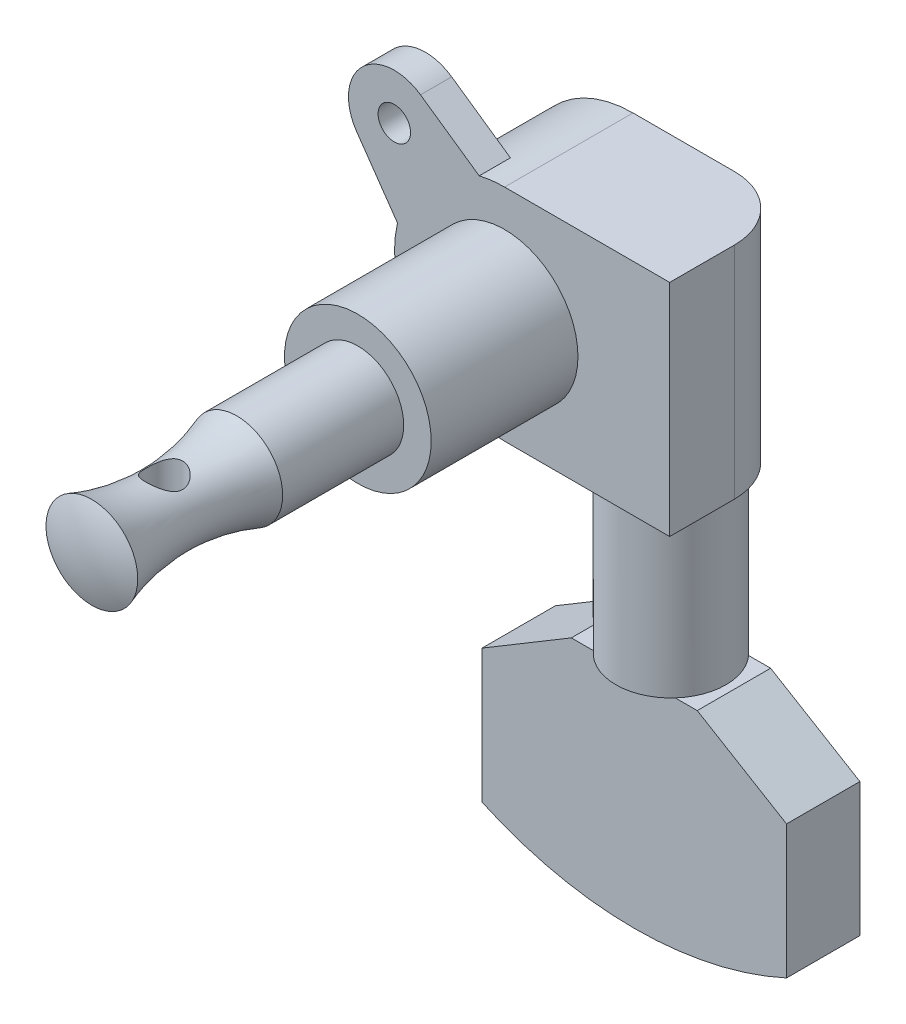
ISO-10303-21;
HEADER;
FILE_DESCRIPTION(('STEP AP214'),'2;1');
FILE_NAME('part.step','',(''),(''),'','','');
FILE_SCHEMA(('AUTOMOTIVE_DESIGN { 1 0 10303 214 1 1 1 1 }'));
ENDSEC;
DATA;
#1=APPLICATION_CONTEXT('core data for automotive mechanical design processes');
#2=APPLICATION_PROTOCOL_DEFINITION('international standard','automotive_design',2000,#1);
#3=PRODUCT_CONTEXT('',#1,'mechanical');
#4=PRODUCT('Part','Part','',(#3));
#5=PRODUCT_RELATED_PRODUCT_CATEGORY('part','',(#4));
#6=PRODUCT_DEFINITION_FORMATION('','',#4);
#7=PRODUCT_DEFINITION_CONTEXT('part definition',#1,'design');
#8=PRODUCT_DEFINITION('design','',#6,#7);
#9=PRODUCT_DEFINITION_SHAPE('','',#8);
#10=(LENGTH_UNIT() NAMED_UNIT(*) SI_UNIT(.MILLI.,.METRE.));
#11=(NAMED_UNIT(*) PLANE_ANGLE_UNIT() SI_UNIT($,.RADIAN.));
#12=(NAMED_UNIT(*) SI_UNIT($,.STERADIAN.) SOLID_ANGLE_UNIT());
#13=UNCERTAINTY_MEASURE_WITH_UNIT(LENGTH_MEASURE(1.E-05),#10,'distance_accuracy_value','');
#14=(GEOMETRIC_REPRESENTATION_CONTEXT(3) GLOBAL_UNCERTAINTY_ASSIGNED_CONTEXT((#13)) GLOBAL_UNIT_ASSIGNED_CONTEXT((#10,
#11,#12)) REPRESENTATION_CONTEXT('',''));
#15=CARTESIAN_POINT('',(0.,0.,0.));
#16=DIRECTION('',(0.,0.,1.));
#17=DIRECTION('',(1.,0.,0.));
#18=AXIS2_PLACEMENT_3D('',#15,#16,#17);
#19=CARTESIAN_POINT('',(7.03,-8.94661103641939,6.94));
#20=DIRECTION('',(0.,0.,-1.));
#21=DIRECTION('',(0.,-1.,0.));
#22=AXIS2_PLACEMENT_3D('',#19,#20,#21);
#23=CYLINDRICAL_SURFACE('',#22,25.3433889635806);
#24=CARTESIAN_POINT('',(7.03,-8.94661103641939,1.86));
#25=DIRECTION('',(0.,0.,-1.));
#26=DIRECTION('',(-1.,0.,0.));
#27=AXIS2_PLACEMENT_3D('',#24,#25,#26);
#28=CIRCLE('',#27,25.3433889635806);
#29=CARTESIAN_POINT('',(17.571,-31.9938382700659,1.86));
#30=VERTEX_POINT('',#29);
#31=CARTESIAN_POINT('',(-3.511,-31.9938382700659,1.86));
#32=VERTEX_POINT('',#31);
#33=EDGE_CURVE('E35',#30,#32,#28,.T.);
#34=ORIENTED_EDGE('',*,*,#33,.F.);
#35=DIRECTION('',(0.,0.,-1.));
#36=VECTOR('',#35,1.);
#37=CARTESIAN_POINT('',(17.571,-31.9938382700659,6.94));
#38=LINE('',#37,#36);
#39=CARTESIAN_POINT('',(17.571,-31.9938382700659,6.94));
#40=VERTEX_POINT('',#39);
#41=EDGE_CURVE('E9',#40,#30,#38,.T.);
#42=ORIENTED_EDGE('',*,*,#41,.F.);
#43=CARTESIAN_POINT('',(7.03,-8.94661103641939,6.94));
#44=DIRECTION('',(0.,0.,1.));
#45=DIRECTION('',(1.,0.,0.));
#46=AXIS2_PLACEMENT_3D('',#43,#44,#45);
#47=CIRCLE('',#46,25.3433889635806);
#48=CARTESIAN_POINT('',(-3.511,-31.9938382700659,6.94));
#49=VERTEX_POINT('',#48);
#50=EDGE_CURVE('E591',#49,#40,#47,.T.);
#51=ORIENTED_EDGE('',*,*,#50,.F.);
#52=DIRECTION('',(0.,0.,-1.));
#53=VECTOR('',#52,1.);
#54=CARTESIAN_POINT('',(-3.511,-31.9938382700659,6.94));
#55=LINE('',#54,#53);
#56=EDGE_CURVE('E582',#32,#49,#55,.F.);
#57=ORIENTED_EDGE('',*,*,#56,.F.);
#58=EDGE_LOOP('',(#34,#42,#51,#57));
#59=FACE_BOUND('',#58,.T.);
#60=ADVANCED_FACE('F15',(#59),#23,.T.);
#61=CARTESIAN_POINT('',(11.3893157644832,-19.05,6.94));
#62=DIRECTION('',(0.513969357533937,0.857808544790824,0.));
#63=DIRECTION('',(-0.857808544790824,0.513969357533937,0.));
#64=AXIS2_PLACEMENT_3D('',#61,#62,#63);
#65=PLANE('',#64);
#66=DIRECTION('',(0.857808544790824,-0.513969357533937,0.));
#67=VECTOR('',#66,1.);
#68=CARTESIAN_POINT('',(0.425134470976299,-12.4806399143139,1.86));
#69=LINE('',#68,#67);
#70=CARTESIAN_POINT('',(11.3893157644832,-19.05,1.86));
#71=VERTEX_POINT('',#70);
#72=CARTESIAN_POINT('',(17.571,-22.7538524438819,1.86));
#73=VERTEX_POINT('',#72);
#74=EDGE_CURVE('E524',#71,#73,#69,.T.);
#75=ORIENTED_EDGE('',*,*,#74,.F.);
#76=DIRECTION('',(0.,0.,-1.));
#77=VECTOR('',#76,1.);
#78=CARTESIAN_POINT('',(11.3893157644832,-19.05,4.4));
#79=LINE('',#78,#77);
#80=CARTESIAN_POINT('',(11.3893157644832,-19.05,6.94));
#81=VERTEX_POINT('',#80);
#82=EDGE_CURVE('E526',#81,#71,#79,.T.);
#83=ORIENTED_EDGE('',*,*,#82,.F.);
#84=DIRECTION('',(-0.857808544790824,0.513969357533937,0.));
#85=VECTOR('',#84,1.);
#86=CARTESIAN_POINT('',(15.9380184717758,-21.7754261131779,6.94));
#87=LINE('',#86,#85);
#88=CARTESIAN_POINT('',(17.571,-22.7538524438819,6.94));
#89=VERTEX_POINT('',#88);
#90=EDGE_CURVE('E593',#89,#81,#87,.T.);
#91=ORIENTED_EDGE('',*,*,#90,.F.);
#92=DIRECTION('',(0.,0.,1.));
#93=VECTOR('',#92,1.);
#94=CARTESIAN_POINT('',(17.571,-22.7538524438819,1.86));
#95=LINE('',#94,#93);
#96=EDGE_CURVE('E26',#73,#89,#95,.T.);
#97=ORIENTED_EDGE('',*,*,#96,.F.);
#98=EDGE_LOOP('',(#75,#83,#91,#97));
#99=FACE_BOUND('',#98,.T.);
#100=ADVANCED_FACE('F252',(#99),#65,.T.);
#101=CARTESIAN_POINT('',(-3.511,-22.7538524438819,6.94));
#102=DIRECTION('',(-0.513969357533937,0.857808544790824,0.));
#103=DIRECTION('',(-0.857808544790824,-0.513969357533937,0.));
#104=AXIS2_PLACEMENT_3D('',#101,#102,#103);
#105=PLANE('',#104);
#106=DIRECTION('',(0.857808544790824,0.513969357533937,0.));
#107=VECTOR('',#106,1.);
#108=CARTESIAN_POINT('',(-1.87801847177582,-21.7754261131779,1.86));
#109=LINE('',#108,#107);
#110=CARTESIAN_POINT('',(-3.511,-22.7538524438819,1.86));
#111=VERTEX_POINT('',#110);
#112=CARTESIAN_POINT('',(2.67068423551684,-19.05,1.86));
#113=VERTEX_POINT('',#112);
#114=EDGE_CURVE('E532',#111,#113,#109,.T.);
#115=ORIENTED_EDGE('',*,*,#114,.F.);
#116=DIRECTION('',(0.,0.,-1.));
#117=VECTOR('',#116,1.);
#118=CARTESIAN_POINT('',(-3.511,-22.7538524438819,6.94));
#119=LINE('',#118,#117);
#120=CARTESIAN_POINT('',(-3.511,-22.7538524438819,6.94));
#121=VERTEX_POINT('',#120);
#122=EDGE_CURVE('E585',#121,#111,#119,.T.);
#123=ORIENTED_EDGE('',*,*,#122,.F.);
#124=DIRECTION('',(-0.857808544790824,-0.513969357533937,0.));
#125=VECTOR('',#124,1.);
#126=CARTESIAN_POINT('',(13.6348655290237,-12.4806399143139,6.94));
#127=LINE('',#126,#125);
#128=CARTESIAN_POINT('',(2.67068423551684,-19.05,6.94));
#129=VERTEX_POINT('',#128);
#130=EDGE_CURVE('E595',#129,#121,#127,.T.);
#131=ORIENTED_EDGE('',*,*,#130,.F.);
#132=DIRECTION('',(0.,0.,1.));
#133=VECTOR('',#132,1.);
#134=CARTESIAN_POINT('',(2.67068423551684,-19.05,4.4));
#135=LINE('',#134,#133);
#136=EDGE_CURVE('E600',#113,#129,#135,.T.);
#137=ORIENTED_EDGE('',*,*,#136,.F.);
#138=EDGE_LOOP('',(#115,#123,#131,#137));
#139=FACE_BOUND('',#138,.T.);
#140=ADVANCED_FACE('F474',(#139),#105,.T.);
#141=CARTESIAN_POINT('',(17.571,-19.05,1.86));
#142=DIRECTION('',(1.,0.,0.));
#143=DIRECTION('',(0.,0.,-1.));
#144=AXIS2_PLACEMENT_3D('',#141,#142,#143);
#145=PLANE('',#144);
#146=ORIENTED_EDGE('',*,*,#41,.T.);
#147=DIRECTION('',(0.,-1.,0.));
#148=VECTOR('',#147,1.);
#149=CARTESIAN_POINT('',(17.571,-19.05,1.86));
#150=LINE('',#149,#148);
#151=EDGE_CURVE('E533',#73,#30,#150,.T.);
#152=ORIENTED_EDGE('',*,*,#151,.F.);
#153=ORIENTED_EDGE('',*,*,#96,.T.);
#154=DIRECTION('',(0.,-1.,0.));
#155=VECTOR('',#154,1.);
#156=CARTESIAN_POINT('',(17.571,-19.05,6.94));
#157=LINE('',#156,#155);
#158=EDGE_CURVE('E579',#89,#40,#157,.T.);
#159=ORIENTED_EDGE('',*,*,#158,.T.);
#160=EDGE_LOOP('',(#146,#152,#153,#159));
#161=FACE_BOUND('',#160,.T.);
#162=ADVANCED_FACE('F465',(#161),#145,.T.);
#163=CARTESIAN_POINT('',(-3.511,-19.05,6.94));
#164=DIRECTION('',(-1.,0.,0.));
#165=DIRECTION('',(0.,0.,1.));
#166=AXIS2_PLACEMENT_3D('',#163,#164,#165);
#167=PLANE('',#166);
#168=ORIENTED_EDGE('',*,*,#56,.T.);
#169=DIRECTION('',(0.,-1.,0.));
#170=VECTOR('',#169,1.);
#171=CARTESIAN_POINT('',(-3.511,-19.05,6.94));
#172=LINE('',#171,#170);
#173=EDGE_CURVE('E597',#121,#49,#172,.T.);
#174=ORIENTED_EDGE('',*,*,#173,.F.);
#175=ORIENTED_EDGE('',*,*,#122,.T.);
#176=DIRECTION('',(0.,-1.,0.));
#177=VECTOR('',#176,1.);
#178=CARTESIAN_POINT('',(-3.511,-19.05,1.86));
#179=LINE('',#178,#177);
#180=EDGE_CURVE('E588',#111,#32,#179,.T.);
#181=ORIENTED_EDGE('',*,*,#180,.T.);
#182=EDGE_LOOP('',(#168,#174,#175,#181));
#183=FACE_BOUND('',#182,.T.);
#184=ADVANCED_FACE('F456',(#183),#167,.T.);
#185=CARTESIAN_POINT('',(17.571,-19.05,6.94));
#186=DIRECTION('',(0.,0.,1.));
#187=DIRECTION('',(1.,0.,0.));
#188=AXIS2_PLACEMENT_3D('',#185,#186,#187);
#189=PLANE('',#188);
#190=ORIENTED_EDGE('',*,*,#50,.T.);
#191=ORIENTED_EDGE('',*,*,#158,.F.);
#192=ORIENTED_EDGE('',*,*,#90,.T.);
#193=DIRECTION('',(1.,0.,0.));
#194=VECTOR('',#193,1.);
#195=CARTESIAN_POINT('',(7.03,-19.05,6.94));
#196=LINE('',#195,#194);
#197=CARTESIAN_POINT('',(9.86980633142473,-19.05,6.94));
#198=VERTEX_POINT('',#197);
#199=EDGE_CURVE('E541',#198,#81,#196,.T.);
#200=ORIENTED_EDGE('',*,*,#199,.F.);
#201=DIRECTION('',(1.,0.,0.));
#202=VECTOR('',#201,1.);
#203=CARTESIAN_POINT('',(7.03,-19.05,6.94));
#204=LINE('',#203,#202);
#205=CARTESIAN_POINT('',(4.19019366857527,-19.05,6.94));
#206=VERTEX_POINT('',#205);
#207=EDGE_CURVE('E556',#206,#198,#204,.T.);
#208=ORIENTED_EDGE('',*,*,#207,.F.);
#209=DIRECTION('',(1.,0.,0.));
#210=VECTOR('',#209,1.);
#211=CARTESIAN_POINT('',(7.03,-19.05,6.94));
#212=LINE('',#211,#210);
#213=EDGE_CURVE('E602',#129,#206,#212,.T.);
#214=ORIENTED_EDGE('',*,*,#213,.F.);
#215=ORIENTED_EDGE('',*,*,#130,.T.);
#216=ORIENTED_EDGE('',*,*,#173,.T.);
#217=EDGE_LOOP('',(#190,#191,#192,#200,#208,#214,#215,#216));
#218=FACE_BOUND('',#217,.T.);
#219=ADVANCED_FACE('F447',(#218),#189,.T.);
#220=CARTESIAN_POINT('',(7.03,-19.05,4.4));
#221=DIRECTION('',(0.,1.,0.));
#222=DIRECTION('',(0.,0.,1.));
#223=AXIS2_PLACEMENT_3D('',#220,#221,#222);
#224=PLANE('',#223);
#225=ORIENTED_EDGE('',*,*,#136,.T.);
#226=ORIENTED_EDGE('',*,*,#213,.T.);
#227=CARTESIAN_POINT('',(7.03,-19.05,4.4));
#228=DIRECTION('',(0.,1.,0.));
#229=DIRECTION('',(0.,0.,1.));
#230=AXIS2_PLACEMENT_3D('',#227,#228,#229);
#231=CIRCLE('',#230,3.81);
#232=CARTESIAN_POINT('',(4.19019366857527,-19.05,1.86));
#233=VERTEX_POINT('',#232);
#234=EDGE_CURVE('E605',#206,#233,#231,.F.);
#235=ORIENTED_EDGE('',*,*,#234,.T.);
#236=DIRECTION('',(-1.,0.,0.));
#237=VECTOR('',#236,1.);
#238=CARTESIAN_POINT('',(7.03,-19.05,1.86));
#239=LINE('',#238,#237);
#240=EDGE_CURVE('E542',#233,#113,#239,.T.);
#241=ORIENTED_EDGE('',*,*,#240,.T.);
#242=EDGE_LOOP('',(#225,#226,#235,#241));
#243=FACE_BOUND('',#242,.T.);
#244=ADVANCED_FACE('F438',(#243),#224,.T.);
#245=CARTESIAN_POINT('',(7.03,-19.05,4.4));
#246=DIRECTION('',(0.,1.,0.));
#247=DIRECTION('',(0.,0.,1.));
#248=AXIS2_PLACEMENT_3D('',#245,#246,#247);
#249=PLANE('',#248);
#250=ORIENTED_EDGE('',*,*,#82,.T.);
#251=DIRECTION('',(-1.,0.,0.));
#252=VECTOR('',#251,1.);
#253=CARTESIAN_POINT('',(7.03,-19.05,1.86));
#254=LINE('',#253,#252);
#255=CARTESIAN_POINT('',(9.86980633142473,-19.05,1.86));
#256=VERTEX_POINT('',#255);
#257=EDGE_CURVE('E538',#71,#256,#254,.T.);
#258=ORIENTED_EDGE('',*,*,#257,.T.);
#259=CARTESIAN_POINT('',(7.03,-19.05,4.4));
#260=DIRECTION('',(0.,1.,0.));
#261=DIRECTION('',(0.,0.,1.));
#262=AXIS2_PLACEMENT_3D('',#259,#260,#261);
#263=CIRCLE('',#262,3.81);
#264=EDGE_CURVE('E547',#256,#198,#263,.F.);
#265=ORIENTED_EDGE('',*,*,#264,.T.);
#266=ORIENTED_EDGE('',*,*,#199,.T.);
#267=EDGE_LOOP('',(#250,#258,#265,#266));
#268=FACE_BOUND('',#267,.T.);
#269=ADVANCED_FACE('F429',(#268),#249,.T.);
#270=CARTESIAN_POINT('',(-3.511,-19.05,1.86));
#271=DIRECTION('',(0.,0.,-1.));
#272=DIRECTION('',(-1.,0.,0.));
#273=AXIS2_PLACEMENT_3D('',#270,#271,#272);
#274=PLANE('',#273);
#275=ORIENTED_EDGE('',*,*,#33,.T.);
#276=ORIENTED_EDGE('',*,*,#180,.F.);
#277=ORIENTED_EDGE('',*,*,#114,.T.);
#278=ORIENTED_EDGE('',*,*,#240,.F.);
#279=DIRECTION('',(-1.,0.,0.));
#280=VECTOR('',#279,1.);
#281=CARTESIAN_POINT('',(7.03,-19.05,1.86));
#282=LINE('',#281,#280);
#283=EDGE_CURVE('E545',#256,#233,#282,.T.);
#284=ORIENTED_EDGE('',*,*,#283,.F.);
#285=ORIENTED_EDGE('',*,*,#257,.F.);
#286=ORIENTED_EDGE('',*,*,#74,.T.);
#287=ORIENTED_EDGE('',*,*,#151,.T.);
#288=EDGE_LOOP('',(#275,#276,#277,#278,#284,#285,#286,#287));
#289=FACE_BOUND('',#288,.T.);
#290=ADVANCED_FACE('F420',(#289),#274,.T.);
#291=CARTESIAN_POINT('',(7.03,-19.05,4.4));
#292=DIRECTION('',(0.,1.,0.));
#293=DIRECTION('',(0.,0.,1.));
#294=AXIS2_PLACEMENT_3D('',#291,#292,#293);
#295=PLANE('',#294);
#296=ORIENTED_EDGE('',*,*,#207,.T.);
#297=CARTESIAN_POINT('',(7.03,-19.05,4.4));
#298=DIRECTION('',(0.,1.,0.));
#299=DIRECTION('',(0.,0.,1.));
#300=AXIS2_PLACEMENT_3D('',#297,#298,#299);
#301=CIRCLE('',#300,3.81);
#302=EDGE_CURVE('E558',#198,#206,#301,.F.);
#303=ORIENTED_EDGE('',*,*,#302,.T.);
#304=EDGE_LOOP('',(#296,#303));
#305=FACE_BOUND('',#304,.T.);
#306=ADVANCED_FACE('F411',(#305),#295,.F.);
#307=CARTESIAN_POINT('',(7.03,-19.05,4.4));
#308=DIRECTION('',(0.,1.,0.));
#309=DIRECTION('',(0.,0.,1.));
#310=AXIS2_PLACEMENT_3D('',#307,#308,#309);
#311=PLANE('',#310);
#312=ORIENTED_EDGE('',*,*,#283,.T.);
#313=CARTESIAN_POINT('',(7.03,-19.05,4.4));
#314=DIRECTION('',(0.,1.,0.));
#315=DIRECTION('',(0.,0.,1.));
#316=AXIS2_PLACEMENT_3D('',#313,#314,#315);
#317=CIRCLE('',#316,3.81);
#318=EDGE_CURVE('E562',#233,#256,#317,.F.);
#319=ORIENTED_EDGE('',*,*,#318,.T.);
#320=EDGE_LOOP('',(#312,#319));
#321=FACE_BOUND('',#320,.T.);
#322=ADVANCED_FACE('F261',(#321),#311,.F.);
#323=CARTESIAN_POINT('',(7.03,-7.62,4.4));
#324=DIRECTION('',(0.,-1.,0.));
#325=DIRECTION('',(0.,0.,-1.));
#326=AXIS2_PLACEMENT_3D('',#323,#324,#325);
#327=CYLINDRICAL_SURFACE('',#326,3.81);
#328=ORIENTED_EDGE('',*,*,#264,.F.);
#329=ORIENTED_EDGE('',*,*,#318,.F.);
#330=ORIENTED_EDGE('',*,*,#234,.F.);
#331=ORIENTED_EDGE('',*,*,#302,.F.);
#332=EDGE_LOOP('',(#328,#329,#330,#331));
#333=FACE_BOUND('',#332,.T.);
#334=CARTESIAN_POINT('',(7.03,-7.62,4.4));
#335=DIRECTION('',(0.,-1.,0.));
#336=DIRECTION('',(0.,0.,-1.));
#337=AXIS2_PLACEMENT_3D('',#334,#335,#336);
#338=CIRCLE('',#337,3.81);
#339=CARTESIAN_POINT('',(7.03,-7.62,0.59));
#340=VERTEX_POINT('',#339);
#341=EDGE_CURVE('E569',#340,#340,#338,.F.);
#342=ORIENTED_EDGE('',*,*,#341,.F.);
#343=EDGE_LOOP('',(#342));
#344=FACE_BOUND('',#343,.T.);
#345=ADVANCED_FACE('F257',(#333,#344),#327,.T.);
#346=CARTESIAN_POINT('',(7.03,-3.81,4.4));
#347=DIRECTION('',(0.,1.,0.));
#348=DIRECTION('',(1.,0.,0.));
#349=AXIS2_PLACEMENT_3D('',#346,#347,#348);
#350=CYLINDRICAL_SURFACE('',#349,4.4);
#351=CARTESIAN_POINT('',(7.03,7.62,4.4));
#352=DIRECTION('',(0.,1.,0.));
#353=DIRECTION('',(-1.,0.,0.));
#354=AXIS2_PLACEMENT_3D('',#351,#352,#353);
#355=CIRCLE('',#354,4.4);
#356=CARTESIAN_POINT('',(7.03,7.62,0.));
#357=VERTEX_POINT('',#356);
#358=CARTESIAN_POINT('',(11.43,7.62,4.4));
#359=VERTEX_POINT('',#358);
#360=EDGE_CURVE('E161',#357,#359,#355,.F.);
#361=ORIENTED_EDGE('',*,*,#360,.T.);
#362=DIRECTION('',(0.,-1.,0.));
#363=VECTOR('',#362,1.);
#364=CARTESIAN_POINT('',(11.43,-3.81,4.4));
#365=LINE('',#364,#363);
#366=CARTESIAN_POINT('',(11.43,-7.62,4.4));
#367=VERTEX_POINT('',#366);
#368=EDGE_CURVE('E197',#359,#367,#365,.T.);
#369=ORIENTED_EDGE('',*,*,#368,.T.);
#370=CARTESIAN_POINT('',(7.03,-7.62,4.4));
#371=DIRECTION('',(0.,-1.,0.));
#372=DIRECTION('',(0.,0.,-1.));
#373=AXIS2_PLACEMENT_3D('',#370,#371,#372);
#374=CIRCLE('',#373,4.4);
#375=CARTESIAN_POINT('',(7.03,-7.62,0.));
#376=VERTEX_POINT('',#375);
#377=EDGE_CURVE('E565',#367,#376,#374,.F.);
#378=ORIENTED_EDGE('',*,*,#377,.T.);
#379=DIRECTION('',(0.,1.,0.));
#380=VECTOR('',#379,1.);
#381=CARTESIAN_POINT('',(7.03,-3.81,0.));
#382=LINE('',#381,#380);
#383=EDGE_CURVE('E568',#376,#357,#382,.T.);
#384=ORIENTED_EDGE('',*,*,#383,.T.);
#385=EDGE_LOOP('',(#361,#369,#378,#384));
#386=FACE_BOUND('',#385,.T.);
#387=ADVANCED_FACE('F253',(#386),#350,.T.);
#388=CARTESIAN_POINT('',(0.,-7.62,0.));
#389=DIRECTION('',(0.,-1.,0.));
#390=DIRECTION('',(0.,0.,-1.));
#391=AXIS2_PLACEMENT_3D('',#388,#389,#390);
#392=PLANE('',#391);
#393=ORIENTED_EDGE('',*,*,#341,.T.);
#394=EDGE_LOOP('',(#393));
#395=FACE_BOUND('',#394,.T.);
#396=ORIENTED_EDGE('',*,*,#377,.F.);
#397=DIRECTION('',(0.,0.,1.));
#398=VECTOR('',#397,1.);
#399=CARTESIAN_POINT('',(11.43,-7.62,0.));
#400=LINE('',#399,#398);
#401=CARTESIAN_POINT('',(11.43,-7.62,8.89));
#402=VERTEX_POINT('',#401);
#403=EDGE_CURVE('E200',#367,#402,#400,.T.);
#404=ORIENTED_EDGE('',*,*,#403,.T.);
#405=DIRECTION('',(1.,0.,0.));
#406=VECTOR('',#405,1.);
#407=CARTESIAN_POINT('',(3.88446841913418,-7.62,8.89));
#408=LINE('',#407,#406);
#409=CARTESIAN_POINT('',(0.,-7.62,8.89));
#410=VERTEX_POINT('',#409);
#411=EDGE_CURVE('E186',#410,#402,#408,.T.);
#412=ORIENTED_EDGE('',*,*,#411,.F.);
#413=DIRECTION('',(0.,0.,1.));
#414=VECTOR('',#413,1.);
#415=CARTESIAN_POINT('',(0.,-7.62,0.));
#416=LINE('',#415,#414);
#417=CARTESIAN_POINT('',(0.,-7.62,0.));
#418=VERTEX_POINT('',#417);
#419=EDGE_CURVE('E155',#418,#410,#416,.T.);
#420=ORIENTED_EDGE('',*,*,#419,.F.);
#421=DIRECTION('',(-1.,0.,0.));
#422=VECTOR('',#421,1.);
#423=CARTESIAN_POINT('',(0.,-7.62,0.));
#424=LINE('',#423,#422);
#425=EDGE_CURVE('E153',#418,#376,#424,.F.);
#426=ORIENTED_EDGE('',*,*,#425,.T.);
#427=EDGE_LOOP('',(#396,#404,#412,#420,#426));
#428=FACE_BOUND('',#427,.T.);
#429=ADVANCED_FACE('F256',(#395,#428),#392,.T.);
#430=CARTESIAN_POINT('',(11.43,-7.62,0.));
#431=DIRECTION('',(1.,0.,0.));
#432=DIRECTION('',(0.,0.,-1.));
#433=AXIS2_PLACEMENT_3D('',#430,#431,#432);
#434=PLANE('',#433);
#435=ORIENTED_EDGE('',*,*,#368,.F.);
#436=DIRECTION('',(0.,0.,1.));
#437=VECTOR('',#436,1.);
#438=CARTESIAN_POINT('',(11.43,7.62,0.));
#439=LINE('',#438,#437);
#440=CARTESIAN_POINT('',(11.43,7.62,8.89));
#441=VERTEX_POINT('',#440);
#442=EDGE_CURVE('E194',#359,#441,#439,.T.);
#443=ORIENTED_EDGE('',*,*,#442,.T.);
#444=DIRECTION('',(0.,1.,0.));
#445=VECTOR('',#444,1.);
#446=CARTESIAN_POINT('',(11.43,0.,8.89));
#447=LINE('',#446,#445);
#448=EDGE_CURVE('E20',#402,#441,#447,.T.);
#449=ORIENTED_EDGE('',*,*,#448,.F.);
#450=ORIENTED_EDGE('',*,*,#403,.F.);
#451=EDGE_LOOP('',(#435,#443,#449,#450));
#452=FACE_BOUND('',#451,.T.);
#453=ADVANCED_FACE('F195',(#452),#434,.T.);
#454=CARTESIAN_POINT('',(-7.63321770290878,7.63321770290877,8.89));
#455=DIRECTION('',(0.,0.,-1.));
#456=DIRECTION('',(0.,-1.,0.));
#457=AXIS2_PLACEMENT_3D('',#454,#455,#456);
#458=CYLINDRICAL_SURFACE('',#457,1.125);
#459=CARTESIAN_POINT('',(-7.63321770290878,7.63321770290877,6.731));
#460=DIRECTION('',(0.,0.,1.));
#461=DIRECTION('',(1.,0.,0.));
#462=AXIS2_PLACEMENT_3D('',#459,#460,#461);
#463=CIRCLE('',#462,1.125);
#464=CARTESIAN_POINT('',(-6.50821770290878,7.63321770290877,6.731));
#465=VERTEX_POINT('',#464);
#466=EDGE_CURVE('E207',#465,#465,#463,.T.);
#467=ORIENTED_EDGE('',*,*,#466,.F.);
#468=EDGE_LOOP('',(#467));
#469=FACE_BOUND('',#468,.T.);
#470=CARTESIAN_POINT('',(-7.63321770290878,7.63321770290877,8.89));
#471=DIRECTION('',(0.,0.,1.));
#472=DIRECTION('',(1.,0.,0.));
#473=AXIS2_PLACEMENT_3D('',#470,#471,#472);
#474=CIRCLE('',#473,1.125);
#475=CARTESIAN_POINT('',(-6.50821770290878,7.63321770290877,8.89));
#476=VERTEX_POINT('',#475);
#477=EDGE_CURVE('E146',#476,#476,#474,.F.);
#478=ORIENTED_EDGE('',*,*,#477,.F.);
#479=EDGE_LOOP('',(#478));
#480=FACE_BOUND('',#479,.T.);
#481=ADVANCED_FACE('F263',(#469,#480),#458,.F.);
#482=CARTESIAN_POINT('',(-7.63321770290878,7.63321770290877,8.89));
#483=DIRECTION('',(0.,0.,-1.));
#484=DIRECTION('',(0.,-1.,0.));
#485=AXIS2_PLACEMENT_3D('',#482,#483,#484);
#486=CYLINDRICAL_SURFACE('',#485,3.175);
#487=CARTESIAN_POINT('',(-7.63321770290878,7.63321770290877,8.89));
#488=DIRECTION('',(0.,0.,1.));
#489=DIRECTION('',(1.,0.,0.));
#490=AXIS2_PLACEMENT_3D('',#487,#488,#489);
#491=CIRCLE('',#490,3.175);
#492=CARTESIAN_POINT('',(-5.82073333344396,10.2400405604205,8.89));
#493=VERTEX_POINT('',#492);
#494=CARTESIAN_POINT('',(-10.2400405604205,5.82073333344396,8.89));
#495=VERTEX_POINT('',#494);
#496=EDGE_CURVE('E180',#493,#495,#491,.T.);
#497=ORIENTED_EDGE('',*,*,#496,.F.);
#498=DIRECTION('',(0.,0.,-1.));
#499=VECTOR('',#498,1.);
#500=CARTESIAN_POINT('',(-5.82073333344397,10.2400405604205,8.89));
#501=LINE('',#500,#499);
#502=CARTESIAN_POINT('',(-5.82073333344396,10.2400405604205,6.731));
#503=VERTEX_POINT('',#502);
#504=EDGE_CURVE('E198',#493,#503,#501,.T.);
#505=ORIENTED_EDGE('',*,*,#504,.T.);
#506=CARTESIAN_POINT('',(-7.63321770290878,7.63321770290877,6.731));
#507=DIRECTION('',(0.,0.,1.));
#508=DIRECTION('',(1.,0.,0.));
#509=AXIS2_PLACEMENT_3D('',#506,#507,#508);
#510=CIRCLE('',#509,3.175);
#511=CARTESIAN_POINT('',(-10.2400405604205,5.82073333344396,6.731));
#512=VERTEX_POINT('',#511);
#513=EDGE_CURVE('E216',#512,#503,#510,.F.);
#514=ORIENTED_EDGE('',*,*,#513,.F.);
#515=DIRECTION('',(0.,0.,-1.));
#516=VECTOR('',#515,1.);
#517=CARTESIAN_POINT('',(-10.2400405604205,5.82073333344396,8.89));
#518=LINE('',#517,#516);
#519=EDGE_CURVE('E203',#495,#512,#518,.T.);
#520=ORIENTED_EDGE('',*,*,#519,.F.);
#521=EDGE_LOOP('',(#497,#505,#514,#520));
#522=FACE_BOUND('',#521,.T.);
#523=ADVANCED_FACE('F266',(#522),#486,.T.);
#524=CARTESIAN_POINT('',(-7.41465026579407,1.7570889095205,8.89));
#525=DIRECTION('',(-0.82104656929504,-0.570861218729075,0.));
#526=DIRECTION('',(0.570861218729075,-0.82104656929504,0.));
#527=AXIS2_PLACEMENT_3D('',#524,#525,#526);
#528=PLANE('',#527);
#529=DIRECTION('',(0.570861218729075,-0.82104656929504,0.));
#530=VECTOR('',#529,1.);
#531=CARTESIAN_POINT('',(-2.90891089332882,-4.72333353384727,8.89));
#532=LINE('',#531,#530);
#533=CARTESIAN_POINT('',(-7.41465026579407,1.7570889095205,8.89));
#534=VERTEX_POINT('',#533);
#535=EDGE_CURVE('E182',#495,#534,#532,.T.);
#536=ORIENTED_EDGE('',*,*,#535,.F.);
#537=ORIENTED_EDGE('',*,*,#519,.T.);
#538=DIRECTION('',(0.570861218729075,-0.82104656929504,0.));
#539=VECTOR('',#538,1.);
#540=CARTESIAN_POINT('',(-9.59730601161965,4.89631426459352,6.731));
#541=LINE('',#540,#539);
#542=CARTESIAN_POINT('',(-7.41465026579407,1.7570889095205,6.731));
#543=VERTEX_POINT('',#542);
#544=EDGE_CURVE('E213',#543,#512,#541,.F.);
#545=ORIENTED_EDGE('',*,*,#544,.F.);
#546=DIRECTION('',(0.,0.,1.));
#547=VECTOR('',#546,1.);
#548=CARTESIAN_POINT('',(-7.41465026579407,1.7570889095205,0.));
#549=LINE('',#548,#547);
#550=EDGE_CURVE('E165',#534,#543,#549,.F.);
#551=ORIENTED_EDGE('',*,*,#550,.F.);
#552=EDGE_LOOP('',(#536,#537,#545,#551));
#553=FACE_BOUND('',#552,.T.);
#554=ADVANCED_FACE('F270',(#553),#528,.T.);
#555=CARTESIAN_POINT('',(-5.82073333344397,10.2400405604205,8.89));
#556=DIRECTION('',(0.570861218729075,0.82104656929504,0.));
#557=DIRECTION('',(-0.82104656929504,0.570861218729075,0.));
#558=AXIS2_PLACEMENT_3D('',#555,#556,#557);
#559=PLANE('',#558);
#560=DIRECTION('',(-0.82104656929504,0.570861218729075,0.));
#561=VECTOR('',#560,1.);
#562=CARTESIAN_POINT('',(5.52125704513567,2.35412678589655,8.89));
#563=LINE('',#562,#561);
#564=CARTESIAN_POINT('',(-1.75708890952051,7.41465026579407,8.89));
#565=VERTEX_POINT('',#564);
#566=EDGE_CURVE('E177',#565,#493,#563,.T.);
#567=ORIENTED_EDGE('',*,*,#566,.F.);
#568=DIRECTION('',(0.,0.,1.));
#569=VECTOR('',#568,1.);
#570=CARTESIAN_POINT('',(-1.75708890952051,7.41465026579407,0.));
#571=LINE('',#570,#569);
#572=CARTESIAN_POINT('',(-1.75708890952051,7.41465026579407,6.731));
#573=VERTEX_POINT('',#572);
#574=EDGE_CURVE('E154',#573,#565,#571,.T.);
#575=ORIENTED_EDGE('',*,*,#574,.F.);
#576=DIRECTION('',(-0.82104656929504,0.570861218729075,0.));
#577=VECTOR('',#576,1.);
#578=CARTESIAN_POINT('',(-4.89631426459353,9.59730601161965,6.731));
#579=LINE('',#578,#577);
#580=EDGE_CURVE('E210',#503,#573,#579,.F.);
#581=ORIENTED_EDGE('',*,*,#580,.F.);
#582=ORIENTED_EDGE('',*,*,#504,.F.);
#583=EDGE_LOOP('',(#567,#575,#581,#582));
#584=FACE_BOUND('',#583,.T.);
#585=ADVANCED_FACE('F352',(#584),#559,.T.);
#586=CARTESIAN_POINT('',(-6.82432551722987,6.82432551722987,6.731));
#587=DIRECTION('',(0.,0.,1.));
#588=DIRECTION('',(1.,0.,0.));
#589=AXIS2_PLACEMENT_3D('',#586,#587,#588);
#590=PLANE('',#589);
#591=ORIENTED_EDGE('',*,*,#466,.T.);
#592=EDGE_LOOP('',(#591));
#593=FACE_BOUND('',#592,.T.);
#594=ORIENTED_EDGE('',*,*,#580,.T.);
#595=CARTESIAN_POINT('',(0.,0.,6.731));
#596=DIRECTION('',(0.,0.,1.));
#597=DIRECTION('',(1.,0.,0.));
#598=AXIS2_PLACEMENT_3D('',#595,#596,#597);
#599=CIRCLE('',#598,7.62);
#600=EDGE_CURVE('E162',#543,#573,#599,.F.);
#601=ORIENTED_EDGE('',*,*,#600,.F.);
#602=ORIENTED_EDGE('',*,*,#544,.T.);
#603=ORIENTED_EDGE('',*,*,#513,.T.);
#604=EDGE_LOOP('',(#594,#601,#602,#603));
#605=FACE_BOUND('',#604,.T.);
#606=ADVANCED_FACE('F344',(#593,#605),#590,.F.);
#607=CARTESIAN_POINT('',(0.,0.,32.4485));
#608=DIRECTION('',(0.,1.,0.));
#609=DIRECTION('',(1.,0.,0.));
#610=AXIS2_PLACEMENT_3D('',#607,#608,#609);
#611=CYLINDRICAL_SURFACE('',#610,1.27);
#612=CARTESIAN_POINT('',(0.000251458670157085,2.3413480341496,33.7184999751057));
#613=CARTESIAN_POINT('',(0.0647728408052782,2.34133590529386,33.7184829530626));
#614=CARTESIAN_POINT('',(0.129379935972329,2.33820139971341,33.7135230992461));
#615=CARTESIAN_POINT('',(0.256611511540769,2.32598923679283,33.6939769841062));
#616=CARTESIAN_POINT('',(0.319231456875065,2.31689888492066,33.6793701603052));
#617=CARTESIAN_POINT('',(0.440379529281579,2.29372491022759,33.6413854482764));
#618=CARTESIAN_POINT('',(0.498927007035058,2.2796671533485,33.6180529597144));
#619=CARTESIAN_POINT('',(0.611081512080611,2.24776892691403,33.5635654080129));
#620=CARTESIAN_POINT('',(0.664689230740472,2.22992898786934,33.5324114418462));
#621=CARTESIAN_POINT('',(0.77041904037173,2.19025256238307,33.4603199324142));
#622=CARTESIAN_POINT('',(0.822056774644287,2.16820809936337,33.4187886727285));
#623=CARTESIAN_POINT('',(0.918104932721226,2.12307338738564,33.3284646200461));
#624=CARTESIAN_POINT('',(0.96250564053882,2.09998178487524,33.2796622307105));
#625=CARTESIAN_POINT('',(1.04881310692777,2.05171502614862,33.1685549058937));
#626=CARTESIAN_POINT('',(1.08960310092176,2.02667112965691,33.1053174094642));
#627=CARTESIAN_POINT('',(1.15982497361249,1.98105184721377,32.9713746737207));
#628=CARTESIAN_POINT('',(1.18927619798712,1.96046887670731,32.900682418322));
#629=CARTESIAN_POINT('',(1.22944776297565,1.93148535652051,32.7720452269509));
#630=CARTESIAN_POINT('',(1.24302018081826,1.92132093262544,32.715390027407));
#631=CARTESIAN_POINT('',(1.26227450382858,1.90674808851586,32.6000577790388));
#632=CARTESIAN_POINT('',(1.2679665303188,1.90233228539291,32.5413834230622));
#633=CARTESIAN_POINT('',(1.27112507603086,1.89989342155303,32.4235417686122));
#634=CARTESIAN_POINT('',(1.26857282885053,1.90188494576462,32.3643736517167));
#635=CARTESIAN_POINT('',(1.255369572542,1.9119889967451,32.2474689156477));
#636=CARTESIAN_POINT('',(1.24471262555166,1.92010601128596,32.1897333780851));
#637=CARTESIAN_POINT('',(1.21616369704254,1.94114867923385,32.0782286969222));
#638=CARTESIAN_POINT('',(1.19840994968599,1.95398210010708,32.0244057583858));
#639=CARTESIAN_POINT('',(1.15635527743713,1.98308852551883,31.9203964008261));
#640=CARTESIAN_POINT('',(1.13205204640935,1.99936274115819,31.8702112706233));
#641=CARTESIAN_POINT('',(1.07265423586415,2.03703050698592,31.7654536517743));
#642=CARTESIAN_POINT('',(1.03641126332738,2.05882040615302,31.7116751434555));
#643=CARTESIAN_POINT('',(0.956372327565015,2.10321120637675,31.610391978598));
#644=CARTESIAN_POINT('',(0.912568628193741,2.12581291913778,31.5628938369248));
#645=CARTESIAN_POINT('',(0.810505567014425,2.17346092748206,31.4679020332496));
#646=CARTESIAN_POINT('',(0.751056146833787,2.19833230505341,31.4215850093856));
#647=CARTESIAN_POINT('',(0.623764818302253,2.24401275811026,31.3396557995669));
#648=CARTESIAN_POINT('',(0.555926537969722,2.26482357973812,31.3040390086678));
#649=CARTESIAN_POINT('',(0.417383766154089,2.29895991252279,31.2468395636349));
#650=CARTESIAN_POINT('',(0.347044824315299,2.31263551623561,31.2245901378726));
#651=CARTESIAN_POINT('',(0.202589087348112,2.3324629815531,31.1925907922774));
#652=CARTESIAN_POINT('',(0.128477869258663,2.33862563220709,31.1828229471754));
#653=CARTESIAN_POINT('',(-0.00934758179218637,2.3423255129305,31.1769485495798));
#654=CARTESIAN_POINT('',(-0.0729607931158726,2.34101391033586,31.1790188918112));
#655=CARTESIAN_POINT('',(-0.198772399497518,2.33251985869397,31.1925581590075));
#656=CARTESIAN_POINT('',(-0.260970827117697,2.32533754490599,31.2040268674371));
#657=CARTESIAN_POINT('',(-0.380067044992192,2.30614359915805,31.235194695703));
#658=CARTESIAN_POINT('',(-0.43707415286555,2.29430972630698,31.2545918127031));
#659=CARTESIAN_POINT('',(-0.54699018193832,2.26679490624868,31.3007811063745));
#660=CARTESIAN_POINT('',(-0.599898353473175,2.25111325748745,31.3275746317234));
#661=CARTESIAN_POINT('',(-0.706287105793718,2.2151914992996,31.3910039238493));
#662=CARTESIAN_POINT('',(-0.75921479478269,2.1946422478252,31.4283892309452));
#663=CARTESIAN_POINT('',(-0.858447398636241,2.15183413210947,31.5103541358037));
#664=CARTESIAN_POINT('',(-0.904744478484003,2.12957329232347,31.5549421143707));
#665=CARTESIAN_POINT('',(-0.996271762157527,2.08189727710097,31.6574740187456));
#666=CARTESIAN_POINT('',(-1.04039323016172,2.05648836890887,31.7164164437608));
#667=CARTESIAN_POINT('',(-1.11820971304927,2.00864763230601,31.8419150555118));
#668=CARTESIAN_POINT('',(-1.15191408503024,1.98621314254697,31.9084643353828));
#669=CARTESIAN_POINT('',(-1.20159035778464,1.95173681090467,32.0330902078412));
#670=CARTESIAN_POINT('',(-1.21981312694852,1.93849843731983,32.0899344098272));
#671=CARTESIAN_POINT('',(-1.24817847894053,1.91749901144827,32.2065512591484));
#672=CARTESIAN_POINT('',(-1.25833267798677,1.90973008671051,32.2663195645098));
#673=CARTESIAN_POINT('',(-1.26999913820355,1.90077961630443,32.3874968044192));
#674=CARTESIAN_POINT('',(-1.27147009835415,1.89962955328534,32.4489121862212));
#675=CARTESIAN_POINT('',(-1.26555099352466,1.90419436348954,32.5710674097945));
#676=CARTESIAN_POINT('',(-1.25815741607166,1.90991195794619,32.6318069741531));
#677=CARTESIAN_POINT('',(-1.23577215303387,1.92673194005915,32.7467845343038));
#678=CARTESIAN_POINT('',(-1.22131554246288,1.9374530277194,32.8011868041209));
#679=CARTESIAN_POINT('',(-1.18574519245585,1.96285147759363,32.9067747369087));
#680=CARTESIAN_POINT('',(-1.16462892046362,1.9775303445753,32.957959167294));
#681=CARTESIAN_POINT('',(-1.1128893200314,2.01178930598006,33.0635731764456));
#682=CARTESIAN_POINT('',(-1.08133683782847,2.03177040019368,33.1174153513645));
#683=CARTESIAN_POINT('',(-1.01105003328538,2.07325860594008,33.219555894694));
#684=CARTESIAN_POINT('',(-0.97230975897037,2.09476697297908,33.2678496145519));
#685=CARTESIAN_POINT('',(-0.880364336680987,2.1415941506516,33.3667722058451));
#686=CARTESIAN_POINT('',(-0.825809022369268,2.16687992005397,33.4161733077603));
#687=CARTESIAN_POINT('',(-0.708134344217036,2.21464212673628,33.5053310125285));
#688=CARTESIAN_POINT('',(-0.645010135043315,2.23711696064047,33.545082123018));
#689=CARTESIAN_POINT('',(-0.511845565608902,2.27669272162339,33.6131753027626));
#690=CARTESIAN_POINT('',(-0.441853101507562,2.29382780954358,33.641590237146));
#691=CARTESIAN_POINT('',(-0.296756765859412,2.32075450340722,33.6856475616974));
#692=CARTESIAN_POINT('',(-0.221673170797086,2.33057356568368,33.7013377265147));
#693=CARTESIAN_POINT('',(-0.121452097247129,2.33783613205861,33.7129159132909));
#694=CARTESIAN_POINT('',(-0.0971826006550555,2.33915252895557,33.7150108787357));
#695=CARTESIAN_POINT('',(-0.0485290063099746,2.34091080234796,33.7178061745098));
#696=CARTESIAN_POINT('',(-0.024144900985144,2.34135262022505,33.7185064113579));
#697=CARTESIAN_POINT('',(0.000251458670157085,2.3413480341496,33.7184999751057));
#698=B_SPLINE_CURVE_WITH_KNOTS('',3,(#612,#613,#614,#615,#616,#617,#618,#619,#620,#621,#622,
#623,#624,#625,#626,#627,#628,#629,#630,#631,#632,#633,#634,#635,#636,#637,#638,#639,#640,#641,
#642,#643,#644,#645,#646,#647,#648,#649,#650,#651,#652,#653,#654,#655,#656,#657,#658,#659,#660,
#661,#662,#663,#664,#665,#666,#667,#668,#669,#670,#671,#672,#673,#674,#675,#676,#677,#678,#679,
#680,#681,#682,#683,#684,#685,#686,#687,#688,#689,#690,#691,#692,#693,#694,#695,#696,#697),
.UNSPECIFIED.,.T.,.F.,(4,2,2,2,2,2,2,2,2,2,2,2,2,2,2,2,2,2,2,2,2,2,2,2,2,2,2,2,2,2,2,2,2,2,2,2,
2,2,2,2,2,2,4),(0.,0.193460354987069,0.387334406564123,0.580213456149904,0.773065469285242,
0.98177027977457,1.19075301684328,1.4275255664149,1.66389233636017,1.84056247872566,
2.01700550044516,2.19385044138652,2.37082507173287,2.54450853880723,2.71825324156714,
2.92272857474916,3.12741438123499,3.36430648227833,3.60109648808431,3.82480131235205,
4.04818450326671,4.23819154265343,4.42819420446341,4.61154910223305,4.79493745545175,
4.99809101241803,5.20148267814774,5.43409331062766,5.66649439057563,5.84918656199586,
6.03161523483814,6.21491091800332,6.39827925402205,6.56951548307168,6.74081690903138,
6.93668631522911,7.13271864425573,7.3651041635937,7.59762163838154,7.82861951189165,
8.05874604487699,8.13189097663365,8.20504081073706),.UNSPECIFIED.);
#699=CARTESIAN_POINT('',(0.000251458670157085,2.3413480341496,33.7184999751057));
#700=VERTEX_POINT('',#699);
#701=EDGE_CURVE('E218',#700,#700,#698,.F.);
#702=ORIENTED_EDGE('',*,*,#701,.F.);
#703=EDGE_LOOP('',(#702));
#704=FACE_BOUND('',#703,.T.);
#705=CARTESIAN_POINT('',(-0.000251458681104282,-2.3413480341496,33.7184999751057));
#706=CARTESIAN_POINT('',(-0.0647728408164107,-2.34133590529351,33.718482953062));
#707=CARTESIAN_POINT('',(-0.129379935983589,-2.33820139971269,33.7135230992449));
#708=CARTESIAN_POINT('',(-0.256611511552161,-2.32598923679137,33.6939769841038));
#709=CARTESIAN_POINT('',(-0.31923145688646,-2.31689888491885,33.6793701603022));
#710=CARTESIAN_POINT('',(-0.440379529292862,-2.29372491022508,33.6413854482722));
#711=CARTESIAN_POINT('',(-0.498927007046226,-2.27966715334567,33.6180529597096));
#712=CARTESIAN_POINT('',(-0.611081512091453,-2.24776892691061,33.563565408007));
#713=CARTESIAN_POINT('',(-0.664689230751105,-2.22992898786566,33.5324114418397));
#714=CARTESIAN_POINT('',(-0.770419040381969,-2.19025256237889,33.4603199324064));
#715=CARTESIAN_POINT('',(-0.822056774654321,-2.16820809935895,33.41878867272));
#716=CARTESIAN_POINT('',(-0.918104932730739,-2.12307338738086,33.3284646200362));
#717=CARTESIAN_POINT('',(-0.962505640548016,-2.09998178487035,33.2796622306999));
#718=CARTESIAN_POINT('',(-1.04881310693604,-2.05171502614371,33.1685549058817));
#719=CARTESIAN_POINT('',(-1.08960310092942,-2.02667112965212,33.1053174094515));
#720=CARTESIAN_POINT('',(-1.1598249736188,-1.98105184720948,32.9713746737067));
#721=CARTESIAN_POINT('',(-1.18927619799269,-1.96046887670339,32.9006824183074));
#722=CARTESIAN_POINT('',(-1.22944776297965,-1.93148535651756,32.7720452269357));
#723=CARTESIAN_POINT('',(-1.24302018082152,-1.921320932623,32.7153900273918));
#724=CARTESIAN_POINT('',(-1.26227450383037,-1.90674808851448,32.6000577790238));
#725=CARTESIAN_POINT('',(-1.26796653031988,-1.90233228539207,32.5413834230473));
#726=CARTESIAN_POINT('',(-1.27112507603057,-1.89989342155325,32.4235417685978));
#727=CARTESIAN_POINT('',(-1.26857282884959,-1.90188494576535,32.3643736517027));
#728=CARTESIAN_POINT('',(-1.25536957253986,-1.91198899674672,32.2474689156344));
#729=CARTESIAN_POINT('',(-1.24471262554898,-1.92010601128797,32.1897333780723));
#730=CARTESIAN_POINT('',(-1.2161636970388,-1.94114867923656,32.0782286969098));
#731=CARTESIAN_POINT('',(-1.19840994968166,-1.95398210011016,32.0244057583735));
#732=CARTESIAN_POINT('',(-1.15635527743164,-1.98308852552255,31.9203964008141));
#733=CARTESIAN_POINT('',(-1.13205204640328,-1.99936274116218,31.8702112706114));
#734=CARTESIAN_POINT('',(-1.07265423585669,-2.03703050699048,31.7654536517626));
#735=CARTESIAN_POINT('',(-1.03641126331908,-2.05882040615788,31.7116751434438));
#736=CARTESIAN_POINT('',(-0.956372327554957,-2.10321120638207,31.6103919785865));
#737=CARTESIAN_POINT('',(-0.912568628182774,-2.12581291914326,31.5628938369135));
#738=CARTESIAN_POINT('',(-0.810505567001711,-2.17346092748758,31.4679020332391));
#739=CARTESIAN_POINT('',(-0.751056146820273,-2.19833230505879,31.4215850093757));
#740=CARTESIAN_POINT('',(-0.623764818287194,-2.24401275811513,31.3396557995584));
#741=CARTESIAN_POINT('',(-0.555926537953917,-2.26482357974264,31.3040390086601));
#742=CARTESIAN_POINT('',(-0.417383766137517,-2.29895991252628,31.2468395636291));
#743=CARTESIAN_POINT('',(-0.347044824298748,-2.31263551623848,31.2245901378679));
#744=CARTESIAN_POINT('',(-0.20258908733185,-2.33246298155473,31.1925907922748));
#745=CARTESIAN_POINT('',(-0.12847786924267,-2.33862563220809,31.1828229471738));
#746=CARTESIAN_POINT('',(0.00934758180754238,-2.34232551293042,31.1769485495799));
#747=CARTESIAN_POINT('',(0.0729607931308928,-2.34101391033531,31.1790188918121));
#748=CARTESIAN_POINT('',(0.198772399511733,-2.33251985869256,31.1925581590097));
#749=CARTESIAN_POINT('',(0.260970827131442,-2.32533754490419,31.20402686744));
#750=CARTESIAN_POINT('',(0.380067045005314,-2.30614359915554,31.2351946957071));
#751=CARTESIAN_POINT('',(0.437074152878503,-2.29430972630411,31.2545918127078));
#752=CARTESIAN_POINT('',(0.546990181950847,-2.26679490624517,31.3007811063805));
#753=CARTESIAN_POINT('',(0.599898353485446,-2.25111325748365,31.32757463173));
#754=CARTESIAN_POINT('',(0.706287105805569,-2.21519149929522,31.3910039238572));
#755=CARTESIAN_POINT('',(0.759214794794348,-2.19464224782052,31.4283892309538));
#756=CARTESIAN_POINT('',(0.858447398647407,-2.1518341321043,31.5103541358139));
#757=CARTESIAN_POINT('',(0.904744478494867,-2.12957329231811,31.5549421143817));
#758=CARTESIAN_POINT('',(0.99627176216754,-2.0818972770954,31.6574740187582));
#759=CARTESIAN_POINT('',(1.04039323017118,-2.05648836890331,31.7164164437742));
#760=CARTESIAN_POINT('',(1.11820971305744,-2.00864763230073,31.8419150555269));
#761=CARTESIAN_POINT('',(1.1519140850377,-1.98621314254195,31.9084643353987));
#762=CARTESIAN_POINT('',(1.20159035779037,-1.95173681090058,32.0330902078578));
#763=CARTESIAN_POINT('',(1.21981312695337,-1.93849843731629,32.0899344098437));
#764=CARTESIAN_POINT('',(1.24817847894367,-1.9174990114459,32.2065512591646));
#765=CARTESIAN_POINT('',(1.25833267798907,-1.90973008670875,32.2663195645258));
#766=CARTESIAN_POINT('',(1.26999913820427,-1.90077961630387,32.3874968044345));
#767=CARTESIAN_POINT('',(1.27147009835412,-1.89962955328537,32.4489121862361));
#768=CARTESIAN_POINT('',(1.26555099352329,-1.9041943634906,32.5710674098083));
#769=CARTESIAN_POINT('',(1.2581574160697,-1.90991195794769,32.6318069741664));
#770=CARTESIAN_POINT('',(1.23577215303083,-1.92673194006141,32.7467845343164));
#771=CARTESIAN_POINT('',(1.22131554245929,-1.93745302772203,32.8011868041333));
#772=CARTESIAN_POINT('',(1.18574519245118,-1.96285147759691,32.9067747369208));
#773=CARTESIAN_POINT('',(1.16462892045843,-1.97753034457885,32.9579591673059));
#774=CARTESIAN_POINT('',(1.11288932002496,-2.01178930598421,33.0635731764573));
#775=CARTESIAN_POINT('',(1.08133683782124,-2.03177040019815,33.1174153513763));
#776=CARTESIAN_POINT('',(1.01105003327654,-2.07325860594509,33.2195558947056));
#777=CARTESIAN_POINT('',(0.972309758960705,-2.0947669729843,33.2678496145634));
#778=CARTESIAN_POINT('',(0.880364336669594,-2.14159415065705,33.3667722058561));
#779=CARTESIAN_POINT('',(0.825809022356998,-2.16687992005942,33.4161733077708));
#780=CARTESIAN_POINT('',(0.70813434420301,-2.2146421267415,33.505331012538));
#781=CARTESIAN_POINT('',(0.645010135028413,-2.23711696064548,33.5450821230268));
#782=CARTESIAN_POINT('',(0.511845565592894,-2.27669272162757,33.6131753027697));
#783=CARTESIAN_POINT('',(0.441853101491387,-2.29382780954719,33.6415902371519));
#784=CARTESIAN_POINT('',(0.296756765843137,-2.32075450340964,33.6856475617013));
#785=CARTESIAN_POINT('',(0.221673170780877,-2.33057356568546,33.7013377265175));
#786=CARTESIAN_POINT('',(0.12145209723193,-2.33783613205952,33.7129159132923));
#787=CARTESIAN_POINT('',(0.0971826006406878,-2.33915252895625,33.7150108787368));
#788=CARTESIAN_POINT('',(0.0485290062972978,-2.34091080234825,33.7178061745103));
#789=CARTESIAN_POINT('',(0.0241449009733275,-2.34135262022518,33.7185064113581));
#790=CARTESIAN_POINT('',(-0.000251458681104282,-2.3413480341496,33.7184999751057));
#791=B_SPLINE_CURVE_WITH_KNOTS('',3,(#705,#706,#707,#708,#709,#710,#711,#712,#713,#714,#715,
#716,#717,#718,#719,#720,#721,#722,#723,#724,#725,#726,#727,#728,#729,#730,#731,#732,#733,#734,
#735,#736,#737,#738,#739,#740,#741,#742,#743,#744,#745,#746,#747,#748,#749,#750,#751,#752,#753,
#754,#755,#756,#757,#758,#759,#760,#761,#762,#763,#764,#765,#766,#767,#768,#769,#770,#771,#772,
#773,#774,#775,#776,#777,#778,#779,#780,#781,#782,#783,#784,#785,#786,#787,#788,#789,#790),
.UNSPECIFIED.,.T.,.F.,(4,2,2,2,2,2,2,2,2,2,2,2,2,2,2,2,2,2,2,2,2,2,2,2,2,2,2,2,2,2,2,2,2,2,2,2,
2,2,2,2,2,2,4),(0.,0.193460354987628,0.387334406565256,0.580213456151586,0.773065469287461,
0.981770279777798,1.19075301684752,1.42752556641967,1.66389233636545,1.84056247873014,
2.01700550044885,2.19385044138934,2.37082507173484,2.5445085388098,2.71825324157031,
2.92272857475387,3.12741438124122,3.36430648228513,3.60109648809163,3.82480131235804,
4.04818450327137,4.2381915426572,4.4281942044663,4.61154910223627,4.79493745545532,
4.99809101242267,5.20148267815347,5.43409331063429,5.66649439058313,5.84918656200204,
6.03161523484302,6.21491091800679,6.39827925402414,6.56951548307399,6.74081690903393,
6.93668631523309,7.13271864426114,7.36510416360008,7.59762163838886,7.82861951189791,
8.05874604488218,8.13189097663624,8.20504081073704),.UNSPECIFIED.);
#792=CARTESIAN_POINT('',(-0.000251458681104282,-2.3413480341496,33.7184999751057));
#793=VERTEX_POINT('',#792);
#794=EDGE_CURVE('E224',#793,#793,#791,.F.);
#795=ORIENTED_EDGE('',*,*,#794,.F.);
#796=EDGE_LOOP('',(#795));
#797=FACE_BOUND('',#796,.T.);
#798=ADVANCED_FACE('F17',(#704,#797),#611,.F.);
#799=CARTESIAN_POINT('',(0.,0.,29.845));
#800=DIRECTION('',(0.,0.,1.));
#801=DIRECTION('',(1.,0.,0.));
#802=AXIS2_PLACEMENT_3D('',#799,#800,#801);
#803=SPHERICAL_SURFACE('',#802,8.25499999999996);
#804=CARTESIAN_POINT('',(0.,0.,37.465));
#805=DIRECTION('',(0.,0.,1.));
#806=DIRECTION('',(1.,0.,0.));
#807=AXIS2_PLACEMENT_3D('',#804,#805,#806);
#808=CIRCLE('',#807,3.175);
#809=CARTESIAN_POINT('',(3.17500000000001,0.,37.465));
#810=VERTEX_POINT('',#809);
#811=EDGE_CURVE('E638',#810,#810,#808,.F.);
#812=ORIENTED_EDGE('',*,*,#811,.F.);
#813=EDGE_LOOP('',(#812));
#814=FACE_BOUND('',#813,.T.);
#815=ADVANCED_FACE('F234',(#814),#803,.T.);
#816=CARTESIAN_POINT('',(0.,0.,32.4485));
#817=DIRECTION('',(0.,0.,-1.));
#818=DIRECTION('',(-1.,0.,0.));
#819=AXIS2_PLACEMENT_3D('',#816,#817,#818);
#820=TOROIDAL_SURFACE('',#819,16.8841964285714,14.5981964285714);
#821=ORIENTED_EDGE('',*,*,#701,.T.);
#822=EDGE_LOOP('',(#821));
#823=FACE_BOUND('',#822,.T.);
#824=ORIENTED_EDGE('',*,*,#794,.T.);
#825=EDGE_LOOP('',(#824));
#826=FACE_BOUND('',#825,.T.);
#827=ORIENTED_EDGE('',*,*,#811,.T.);
#828=EDGE_LOOP('',(#827));
#829=FACE_BOUND('',#828,.T.);
#830=CARTESIAN_POINT('',(0.,0.,27.432));
#831=DIRECTION('',(0.,0.,1.));
#832=DIRECTION('',(1.,0.,0.));
#833=AXIS2_PLACEMENT_3D('',#830,#831,#832);
#834=CIRCLE('',#833,3.175);
#835=CARTESIAN_POINT('',(3.175,0.,27.432));
#836=VERTEX_POINT('',#835);
#837=EDGE_CURVE('E636',#836,#836,#834,.F.);
#838=ORIENTED_EDGE('',*,*,#837,.F.);
#839=EDGE_LOOP('',(#838));
#840=FACE_BOUND('',#839,.T.);
#841=ADVANCED_FACE('F228',(#823,#826,#829,#840),#820,.F.);
#842=CARTESIAN_POINT('',(0.,0.,23.241));
#843=DIRECTION('',(0.,0.,-1.));
#844=DIRECTION('',(-1.,0.,0.));
#845=AXIS2_PLACEMENT_3D('',#842,#843,#844);
#846=CYLINDRICAL_SURFACE('',#845,3.175);
#847=CARTESIAN_POINT('',(0.,0.,19.05));
#848=DIRECTION('',(0.,0.,1.));
#849=DIRECTION('',(1.,0.,0.));
#850=AXIS2_PLACEMENT_3D('',#847,#848,#849);
#851=CIRCLE('',#850,3.175);
#852=CARTESIAN_POINT('',(3.175,0.,19.05));
#853=VERTEX_POINT('',#852);
#854=EDGE_CURVE('E633',#853,#853,#851,.F.);
#855=ORIENTED_EDGE('',*,*,#854,.F.);
#856=EDGE_LOOP('',(#855));
#857=FACE_BOUND('',#856,.T.);
#858=ORIENTED_EDGE('',*,*,#837,.T.);
#859=EDGE_LOOP('',(#858));
#860=FACE_BOUND('',#859,.T.);
#861=ADVANCED_FACE('F233',(#857,#860),#846,.T.);
#862=CARTESIAN_POINT('',(0.,0.,8.89));
#863=DIRECTION('',(0.,0.,1.));
#864=DIRECTION('',(1.,0.,0.));
#865=AXIS2_PLACEMENT_3D('',#862,#863,#864);
#866=CYLINDRICAL_SURFACE('',#865,5.07999999999999);
#867=CARTESIAN_POINT('',(0.,0.,19.05));
#868=DIRECTION('',(0.,0.,1.));
#869=DIRECTION('',(1.,0.,0.));
#870=AXIS2_PLACEMENT_3D('',#867,#868,#869);
#871=CIRCLE('',#870,5.07999999999999);
#872=CARTESIAN_POINT('',(5.07999999999999,0.,19.05));
#873=VERTEX_POINT('',#872);
#874=EDGE_CURVE('E630',#873,#873,#871,.T.);
#875=ORIENTED_EDGE('',*,*,#874,.F.);
#876=EDGE_LOOP('',(#875));
#877=FACE_BOUND('',#876,.T.);
#878=CARTESIAN_POINT('',(0.,0.,8.89));
#879=DIRECTION('',(0.,0.,1.));
#880=DIRECTION('',(1.,0.,0.));
#881=AXIS2_PLACEMENT_3D('',#878,#879,#880);
#882=CIRCLE('',#881,5.07999999999999);
#883=CARTESIAN_POINT('',(5.07999999999999,0.,8.89));
#884=VERTEX_POINT('',#883);
#885=EDGE_CURVE('E171',#884,#884,#882,.F.);
#886=ORIENTED_EDGE('',*,*,#885,.F.);
#887=EDGE_LOOP('',(#886));
#888=FACE_BOUND('',#887,.T.);
#889=ADVANCED_FACE('F241',(#877,#888),#866,.T.);
#890=CARTESIAN_POINT('',(0.,0.,19.05));
#891=DIRECTION('',(0.,0.,1.));
#892=DIRECTION('',(1.,0.,0.));
#893=AXIS2_PLACEMENT_3D('',#890,#891,#892);
#894=PLANE('',#893);
#895=ORIENTED_EDGE('',*,*,#854,.T.);
#896=EDGE_LOOP('',(#895));
#897=FACE_BOUND('',#896,.T.);
#898=ORIENTED_EDGE('',*,*,#874,.T.);
#899=EDGE_LOOP('',(#898));
#900=FACE_BOUND('',#899,.T.);
#901=ADVANCED_FACE('F237',(#897,#900),#894,.T.);
#902=CARTESIAN_POINT('',(0.,0.,0.));
#903=DIRECTION('',(0.,0.,1.));
#904=DIRECTION('',(1.,0.,0.));
#905=AXIS2_PLACEMENT_3D('',#902,#903,#904);
#906=CYLINDRICAL_SURFACE('',#905,7.62);
#907=ORIENTED_EDGE('',*,*,#574,.T.);
#908=CARTESIAN_POINT('',(0.,0.,8.89));
#909=DIRECTION('',(0.,0.,1.));
#910=DIRECTION('',(1.,0.,0.));
#911=AXIS2_PLACEMENT_3D('',#908,#909,#910);
#912=CIRCLE('',#911,7.62);
#913=CARTESIAN_POINT('',(0.,7.62,8.89));
#914=VERTEX_POINT('',#913);
#915=EDGE_CURVE('E133',#914,#565,#912,.T.);
#916=ORIENTED_EDGE('',*,*,#915,.F.);
#917=DIRECTION('',(0.,0.,1.));
#918=VECTOR('',#917,1.);
#919=CARTESIAN_POINT('',(0.,7.62,0.));
#920=LINE('',#919,#918);
#921=CARTESIAN_POINT('',(0.,7.62,0.));
#922=VERTEX_POINT('',#921);
#923=EDGE_CURVE('E136',#922,#914,#920,.T.);
#924=ORIENTED_EDGE('',*,*,#923,.F.);
#925=CARTESIAN_POINT('',(0.,0.,0.));
#926=DIRECTION('',(0.,0.,1.));
#927=DIRECTION('',(1.,0.,0.));
#928=AXIS2_PLACEMENT_3D('',#925,#926,#927);
#929=CIRCLE('',#928,7.62);
#930=EDGE_CURVE('E140',#922,#418,#929,.T.);
#931=ORIENTED_EDGE('',*,*,#930,.T.);
#932=ORIENTED_EDGE('',*,*,#419,.T.);
#933=CARTESIAN_POINT('',(0.,0.,8.89));
#934=DIRECTION('',(0.,0.,1.));
#935=DIRECTION('',(1.,0.,0.));
#936=AXIS2_PLACEMENT_3D('',#933,#934,#935);
#937=CIRCLE('',#936,7.62);
#938=EDGE_CURVE('E184',#534,#410,#937,.T.);
#939=ORIENTED_EDGE('',*,*,#938,.F.);
#940=ORIENTED_EDGE('',*,*,#550,.T.);
#941=ORIENTED_EDGE('',*,*,#600,.T.);
#942=EDGE_LOOP('',(#907,#916,#924,#931,#932,#939,#940,#941));
#943=FACE_BOUND('',#942,.T.);
#944=ADVANCED_FACE('F138',(#943),#906,.T.);
#945=CARTESIAN_POINT('',(11.43,7.62,0.));
#946=DIRECTION('',(0.,1.,0.));
#947=DIRECTION('',(-1.,0.,0.));
#948=AXIS2_PLACEMENT_3D('',#945,#946,#947);
#949=PLANE('',#948);
#950=ORIENTED_EDGE('',*,*,#360,.F.);
#951=DIRECTION('',(1.,0.,0.));
#952=VECTOR('',#951,1.);
#953=CARTESIAN_POINT('',(11.43,7.62,0.));
#954=LINE('',#953,#952);
#955=EDGE_CURVE('E145',#357,#922,#954,.F.);
#956=ORIENTED_EDGE('',*,*,#955,.T.);
#957=ORIENTED_EDGE('',*,*,#923,.T.);
#958=DIRECTION('',(-1.,0.,0.));
#959=VECTOR('',#958,1.);
#960=CARTESIAN_POINT('',(3.88446841913418,7.62,8.89));
#961=LINE('',#960,#959);
#962=EDGE_CURVE('E174',#441,#914,#961,.T.);
#963=ORIENTED_EDGE('',*,*,#962,.F.);
#964=ORIENTED_EDGE('',*,*,#442,.F.);
#965=EDGE_LOOP('',(#950,#956,#957,#963,#964));
#966=FACE_BOUND('',#965,.T.);
#967=ADVANCED_FACE('F158',(#966),#949,.T.);
#968=CARTESIAN_POINT('',(3.88446841913418,0.,8.89));
#969=DIRECTION('',(0.,0.,1.));
#970=DIRECTION('',(1.,0.,0.));
#971=AXIS2_PLACEMENT_3D('',#968,#969,#970);
#972=PLANE('',#971);
#973=ORIENTED_EDGE('',*,*,#477,.T.);
#974=EDGE_LOOP('',(#973));
#975=FACE_BOUND('',#974,.T.);
#976=ORIENTED_EDGE('',*,*,#885,.T.);
#977=EDGE_LOOP('',(#976));
#978=FACE_BOUND('',#977,.T.);
#979=ORIENTED_EDGE('',*,*,#962,.T.);
#980=ORIENTED_EDGE('',*,*,#915,.T.);
#981=ORIENTED_EDGE('',*,*,#566,.T.);
#982=ORIENTED_EDGE('',*,*,#496,.T.);
#983=ORIENTED_EDGE('',*,*,#535,.T.);
#984=ORIENTED_EDGE('',*,*,#938,.T.);
#985=ORIENTED_EDGE('',*,*,#411,.T.);
#986=ORIENTED_EDGE('',*,*,#448,.T.);
#987=EDGE_LOOP('',(#979,#980,#981,#982,#983,#984,#985,#986));
#988=FACE_BOUND('',#987,.T.);
#989=ADVANCED_FACE('F191',(#975,#978,#988),#972,.T.);
#990=CARTESIAN_POINT('',(3.88446841913418,0.,0.));
#991=DIRECTION('',(0.,0.,1.));
#992=DIRECTION('',(1.,0.,0.));
#993=AXIS2_PLACEMENT_3D('',#990,#991,#992);
#994=PLANE('',#993);
#995=ORIENTED_EDGE('',*,*,#383,.F.);
#996=ORIENTED_EDGE('',*,*,#425,.F.);
#997=ORIENTED_EDGE('',*,*,#930,.F.);
#998=ORIENTED_EDGE('',*,*,#955,.F.);
#999=EDGE_LOOP('',(#995,#996,#997,#998));
#1000=FACE_BOUND('',#999,.T.);
#1001=ADVANCED_FACE('F151',(#1000),#994,.F.);
#1002=CLOSED_SHELL('',(#60,#100,#140,#162,#184,#219,#244,#269,#290,#306,#322,#345,#387,#429,
#453,#481,#523,#554,#585,#606,#798,#815,#841,#861,#889,#901,#944,#967,#989,#1001));
#1003=MANIFOLD_SOLID_BREP('B1',#1002);
#1004=ADVANCED_BREP_SHAPE_REPRESENTATION('',(#18,#1003),#14);
#1005=SHAPE_DEFINITION_REPRESENTATION(#9,#1004);
ENDSEC;
END-ISO-10303-21;
